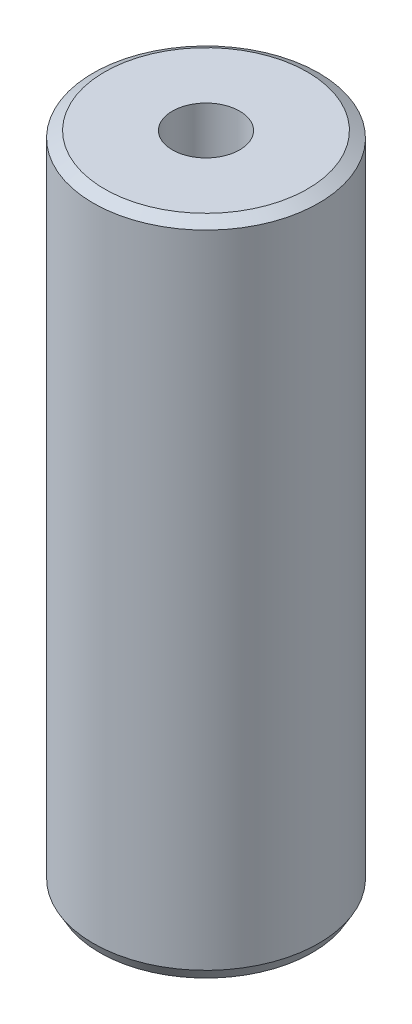
ISO-10303-21;
HEADER;
FILE_DESCRIPTION(('STEP AP214'),'2;1');
FILE_NAME('part.step','',(''),(''),'','','');
FILE_SCHEMA(('AUTOMOTIVE_DESIGN { 1 0 10303 214 1 1 1 1 }'));
ENDSEC;
DATA;
#1=APPLICATION_CONTEXT('core data for automotive mechanical design processes');
#2=APPLICATION_PROTOCOL_DEFINITION('international standard','automotive_design',2000,#1);
#3=PRODUCT_CONTEXT('',#1,'mechanical');
#4=PRODUCT('Part','Part','',(#3));
#5=PRODUCT_RELATED_PRODUCT_CATEGORY('part','',(#4));
#6=PRODUCT_DEFINITION_FORMATION('','',#4);
#7=PRODUCT_DEFINITION_CONTEXT('part definition',#1,'design');
#8=PRODUCT_DEFINITION('design','',#6,#7);
#9=PRODUCT_DEFINITION_SHAPE('','',#8);
#10=(LENGTH_UNIT() NAMED_UNIT(*) SI_UNIT(.MILLI.,.METRE.));
#11=(NAMED_UNIT(*) PLANE_ANGLE_UNIT() SI_UNIT($,.RADIAN.));
#12=(NAMED_UNIT(*) SI_UNIT($,.STERADIAN.) SOLID_ANGLE_UNIT());
#13=UNCERTAINTY_MEASURE_WITH_UNIT(LENGTH_MEASURE(1.E-05),#10,'distance_accuracy_value','');
#14=(GEOMETRIC_REPRESENTATION_CONTEXT(3) GLOBAL_UNCERTAINTY_ASSIGNED_CONTEXT((#13)) GLOBAL_UNIT_ASSIGNED_CONTEXT((#10,
#11,#12)) REPRESENTATION_CONTEXT('',''));
#15=CARTESIAN_POINT('',(0.,0.,0.));
#16=DIRECTION('',(0.,0.,1.));
#17=DIRECTION('',(1.,0.,0.));
#18=AXIS2_PLACEMENT_3D('',#15,#16,#17);
#19=CARTESIAN_POINT('',(0.,189.898432150848,0.));
#20=DIRECTION('',(0.,-1.,0.));
#21=DIRECTION('',(0.,0.,-1.));
#22=AXIS2_PLACEMENT_3D('',#19,#20,#21);
#23=CYLINDRICAL_SURFACE('',#22,32.5);
#24=CARTESIAN_POINT('',(0.,188.01309010159,0.));
#25=DIRECTION('',(0.,1.,0.));
#26=DIRECTION('',(0.,0.,1.));
#27=AXIS2_PLACEMENT_3D('',#24,#25,#26);
#28=CIRCLE('',#27,32.5);
#29=CARTESIAN_POINT('',(0.,188.01309010159,-32.5));
#30=VERTEX_POINT('',#29);
#31=EDGE_CURVE('E50',#30,#30,#28,.F.);
#32=ORIENTED_EDGE('',*,*,#31,.T.);
#33=EDGE_LOOP('',(#32));
#34=FACE_BOUND('',#33,.T.);
#35=CARTESIAN_POINT('',(0.,3.26550821896204,0.));
#36=DIRECTION('',(0.,1.,0.));
#37=DIRECTION('',(0.,0.,1.));
#38=AXIS2_PLACEMENT_3D('',#35,#36,#37);
#39=CIRCLE('',#38,32.5);
#40=CARTESIAN_POINT('',(0.,3.26550821896204,32.5));
#41=VERTEX_POINT('',#40);
#42=EDGE_CURVE('E51',#41,#41,#39,.T.);
#43=ORIENTED_EDGE('',*,*,#42,.T.);
#44=EDGE_LOOP('',(#43));
#45=FACE_BOUND('',#44,.T.);
#46=ADVANCED_FACE('F39',(#34,#45),#23,.T.);
#47=CARTESIAN_POINT('',(0.,189.898432150848,0.));
#48=DIRECTION('',(0.,1.,0.));
#49=DIRECTION('',(0.,0.,1.));
#50=AXIS2_PLACEMENT_3D('',#47,#48,#49);
#51=PLANE('',#50);
#52=CARTESIAN_POINT('',(0.,189.898432150848,0.));
#53=DIRECTION('',(0.,1.,0.));
#54=DIRECTION('',(0.,0.,1.));
#55=AXIS2_PLACEMENT_3D('',#52,#53,#54);
#56=CIRCLE('',#55,29.234491781038);
#57=CARTESIAN_POINT('',(0.,189.898432150848,-29.234491781038));
#58=VERTEX_POINT('',#57);
#59=EDGE_CURVE('E54',#58,#58,#56,.T.);
#60=ORIENTED_EDGE('',*,*,#59,.T.);
#61=EDGE_LOOP('',(#60));
#62=FACE_BOUND('',#61,.T.);
#63=CARTESIAN_POINT('',(0.,189.898432150848,0.));
#64=DIRECTION('',(0.,1.,0.));
#65=DIRECTION('',(0.,0.,1.));
#66=AXIS2_PLACEMENT_3D('',#63,#64,#65);
#67=CIRCLE('',#66,9.69932187311989);
#68=CARTESIAN_POINT('',(0.,189.898432150848,9.69932187311989));
#69=VERTEX_POINT('',#68);
#70=EDGE_CURVE('E58',#69,#69,#67,.T.);
#71=ORIENTED_EDGE('',*,*,#70,.F.);
#72=EDGE_LOOP('',(#71));
#73=FACE_BOUND('',#72,.T.);
#74=ADVANCED_FACE('F69',(#62,#73),#51,.T.);
#75=CARTESIAN_POINT('',(0.,0.,0.));
#76=DIRECTION('',(0.,1.,0.));
#77=DIRECTION('',(0.,0.,1.));
#78=AXIS2_PLACEMENT_3D('',#75,#76,#77);
#79=PLANE('',#78);
#80=CARTESIAN_POINT('',(0.,0.,0.));
#81=DIRECTION('',(0.,1.,0.));
#82=DIRECTION('',(0.,0.,1.));
#83=AXIS2_PLACEMENT_3D('',#80,#81,#82);
#84=CIRCLE('',#83,30.6146579507413);
#85=CARTESIAN_POINT('',(0.,0.,30.6146579507413));
#86=VERTEX_POINT('',#85);
#87=EDGE_CURVE('E10',#86,#86,#84,.F.);
#88=ORIENTED_EDGE('',*,*,#87,.T.);
#89=EDGE_LOOP('',(#88));
#90=FACE_BOUND('',#89,.T.);
#91=CARTESIAN_POINT('',(0.,0.,0.));
#92=DIRECTION('',(0.,1.,0.));
#93=DIRECTION('',(0.,0.,1.));
#94=AXIS2_PLACEMENT_3D('',#91,#92,#93);
#95=CIRCLE('',#94,9.69932187311989);
#96=CARTESIAN_POINT('',(0.,0.,9.69932187311989));
#97=VERTEX_POINT('',#96);
#98=EDGE_CURVE('E63',#97,#97,#95,.T.);
#99=ORIENTED_EDGE('',*,*,#98,.T.);
#100=EDGE_LOOP('',(#99));
#101=FACE_BOUND('',#100,.T.);
#102=ADVANCED_FACE('F75',(#90,#101),#79,.F.);
#103=CARTESIAN_POINT('',(0.,189.898432150848,0.));
#104=DIRECTION('',(0.,-1.,0.));
#105=DIRECTION('',(0.,0.,-1.));
#106=AXIS2_PLACEMENT_3D('',#103,#104,#105);
#107=CYLINDRICAL_SURFACE('',#106,9.69932187311989);
#108=ORIENTED_EDGE('',*,*,#70,.T.);
#109=EDGE_LOOP('',(#108));
#110=FACE_BOUND('',#109,.T.);
#111=ORIENTED_EDGE('',*,*,#98,.F.);
#112=EDGE_LOOP('',(#111));
#113=FACE_BOUND('',#112,.T.);
#114=ADVANCED_FACE('F70',(#110,#113),#107,.F.);
#115=CARTESIAN_POINT('',(0.,189.898432150848,0.));
#116=DIRECTION('',(0.,-1.,0.));
#117=DIRECTION('',(0.,0.,-1.));
#118=AXIS2_PLACEMENT_3D('',#115,#116,#117);
#119=CONICAL_SURFACE('',#118,29.234491781038,1.04719755119659);
#120=CARTESIAN_POINT('',(0.,188.01309010159,-32.5));
#121=CARTESIAN_POINT('',(0.,188.032729081269,-32.4659842893858));
#122=CARTESIAN_POINT('',(0.,188.052368060949,-32.4319685787716));
#123=CARTESIAN_POINT('',(0.,188.091646020309,-32.3639371575433));
#124=CARTESIAN_POINT('',(0.,188.111284999989,-32.3299214469291));
#125=CARTESIAN_POINT('',(0.,188.150562959348,-32.2618900257007));
#126=CARTESIAN_POINT('',(0.,188.170201939028,-32.2278743150865));
#127=CARTESIAN_POINT('',(0.,188.209479898387,-32.1598428938581));
#128=CARTESIAN_POINT('',(0.,188.229118878067,-32.125827183244));
#129=CARTESIAN_POINT('',(0.,188.268396837427,-32.0577957620156));
#130=CARTESIAN_POINT('',(0.,188.288035817107,-32.0237800514014));
#131=CARTESIAN_POINT('',(0.,188.327313776466,-31.955748630173));
#132=CARTESIAN_POINT('',(0.,188.346952756146,-31.9217329195588));
#133=CARTESIAN_POINT('',(0.,188.386230715505,-31.8537014983305));
#134=CARTESIAN_POINT('',(0.,188.405869695185,-31.8196857877163));
#135=CARTESIAN_POINT('',(0.,188.445147654545,-31.7516543664879));
#136=CARTESIAN_POINT('',(0.,188.464786634225,-31.7176386558737));
#137=CARTESIAN_POINT('',(0.,188.504064593584,-31.6496072346453));
#138=CARTESIAN_POINT('',(0.,188.523703573264,-31.6155915240311));
#139=CARTESIAN_POINT('',(0.,188.562981532623,-31.5475601028028));
#140=CARTESIAN_POINT('',(0.,188.582620512303,-31.5135443921886));
#141=CARTESIAN_POINT('',(0.,188.621898471663,-31.4455129709602));
#142=CARTESIAN_POINT('',(0.,188.641537451343,-31.411497260346));
#143=CARTESIAN_POINT('',(0.,188.680815410702,-31.3434658391176));
#144=CARTESIAN_POINT('',(0.,188.700454390382,-31.3094501285034));
#145=CARTESIAN_POINT('',(0.,188.739732349741,-31.2414187072751));
#146=CARTESIAN_POINT('',(0.,188.759371329421,-31.2074029966609));
#147=CARTESIAN_POINT('',(0.,188.798649288781,-31.1393715754325));
#148=CARTESIAN_POINT('',(0.,188.818288268461,-31.1053558648183));
#149=CARTESIAN_POINT('',(0.,188.85756622782,-31.0373244435899));
#150=CARTESIAN_POINT('',(0.,188.8772052075,-31.0033087329758));
#151=CARTESIAN_POINT('',(0.,188.916483166859,-30.9352773117474));
#152=CARTESIAN_POINT('',(0.,188.936122146539,-30.9012616011332));
#153=CARTESIAN_POINT('',(0.,188.975400105899,-30.8332301799048));
#154=CARTESIAN_POINT('',(0.,188.995039085579,-30.7992144692906));
#155=CARTESIAN_POINT('',(0.,189.034317044938,-30.7311830480623));
#156=CARTESIAN_POINT('',(0.,189.053956024618,-30.6971673374481));
#157=CARTESIAN_POINT('',(0.,189.093233983977,-30.6291359162197));
#158=CARTESIAN_POINT('',(0.,189.112872963657,-30.5951202056055));
#159=CARTESIAN_POINT('',(0.,189.152150923017,-30.5270887843771));
#160=CARTESIAN_POINT('',(0.,189.171789902697,-30.4930730737629));
#161=CARTESIAN_POINT('',(0.,189.211067862056,-30.4250416525346));
#162=CARTESIAN_POINT('',(0.,189.230706841736,-30.3910259419204));
#163=CARTESIAN_POINT('',(0.,189.269984801095,-30.322994520692));
#164=CARTESIAN_POINT('',(0.,189.289623780775,-30.2889788100778));
#165=CARTESIAN_POINT('',(0.,189.328901740135,-30.2209473888494));
#166=CARTESIAN_POINT('',(0.,189.348540719815,-30.1869316782352));
#167=CARTESIAN_POINT('',(0.,189.387818679174,-30.1189002570069));
#168=CARTESIAN_POINT('',(0.,189.407457658854,-30.0848845463927));
#169=CARTESIAN_POINT('',(0.,189.446735618213,-30.0168531251643));
#170=CARTESIAN_POINT('',(0.,189.466374597893,-29.9828374145501));
#171=CARTESIAN_POINT('',(0.,189.505652557253,-29.9148059933217));
#172=CARTESIAN_POINT('',(0.,189.525291536933,-29.8807902827076));
#173=CARTESIAN_POINT('',(0.,189.564569496292,-29.8127588614792));
#174=CARTESIAN_POINT('',(0.,189.584208475972,-29.778743150865));
#175=CARTESIAN_POINT('',(0.,189.623486435331,-29.7107117296366));
#176=CARTESIAN_POINT('',(0.,189.643125415011,-29.6766960190224));
#177=CARTESIAN_POINT('',(0.,189.682403374371,-29.608664597794));
#178=CARTESIAN_POINT('',(0.,189.702042354051,-29.5746488871799));
#179=CARTESIAN_POINT('',(0.,189.74132031341,-29.5066174659515));
#180=CARTESIAN_POINT('',(0.,189.76095929309,-29.4726017553373));
#181=CARTESIAN_POINT('',(0.,189.800237252449,-29.4045703341089));
#182=CARTESIAN_POINT('',(0.,189.819876232129,-29.3705546234947));
#183=CARTESIAN_POINT('',(0.,189.859154191489,-29.3025232022664));
#184=CARTESIAN_POINT('',(0.,189.878793171169,-29.2685074916522));
#185=CARTESIAN_POINT('',(0.,189.898432150848,-29.234491781038));
#186=B_SPLINE_CURVE_WITH_KNOTS('',3,(#120,#121,#122,#123,#124,#125,#126,#127,#128,#129,#130,
#131,#132,#133,#134,#135,#136,#137,#138,#139,#140,#141,#142,#143,#144,#145,#146,#147,#148,#149,
#150,#151,#152,#153,#154,#155,#156,#157,#158,#159,#160,#161,#162,#163,#164,#165,#166,#167,#168,
#169,#170,#171,#172,#173,#174,#175,#176,#177,#178,#179,#180,#181,#182,#183,#184,#185),
.UNSPECIFIED.,.F.,.F.,(4,2,2,2,2,2,2,2,2,2,2,2,2,2,2,2,2,2,2,2,2,2,2,2,2,2,2,2,2,2,2,2,4),(0.,
0.117833878078651,0.235667756157322,0.353501634235993,0.471335512314664,0.589169390393329,
0.707003268472,0.824837146550657,0.942671024629328,1.06050490270799,1.17833878078666,
1.29617265886533,1.41400653694401,1.53184041502266,1.64967429310133,1.76750817118,
1.88534204925867,2.00317592733734,2.121009805416,2.23884368349468,2.35667756157333,
2.474511439652,2.59234531773067,2.71017919580934,2.82801307388801,2.94584695196668,
3.06368083004533,3.181514708124,3.29934858620267,3.41718246428134,3.53501634236001,
3.65285022043868,3.77068409851735),.UNSPECIFIED.);
#187=EDGE_CURVE('BSEAM81',#30,#58,#186,.T.);
#188=ORIENTED_EDGE('',*,*,#31,.F.);
#189=ORIENTED_EDGE('',*,*,#59,.F.);
#190=ORIENTED_EDGE('',*,*,#187,.T.);
#191=ORIENTED_EDGE('',*,*,#187,.F.);
#192=EDGE_LOOP('',(#188,#190,#189,#191));
#193=FACE_BOUND('',#192,.T.);
#194=ADVANCED_FACE('F81',(#193),#119,.T.);
#195=CARTESIAN_POINT('',(0.,3.26550821896204,0.));
#196=DIRECTION('',(0.,1.,0.));
#197=DIRECTION('',(0.,0.,1.));
#198=AXIS2_PLACEMENT_3D('',#195,#196,#197);
#199=CONICAL_SURFACE('',#198,32.5,0.523598775598304);
#200=ORIENTED_EDGE('',*,*,#87,.F.);
#201=EDGE_LOOP('',(#200));
#202=FACE_BOUND('',#201,.T.);
#203=ORIENTED_EDGE('',*,*,#42,.F.);
#204=EDGE_LOOP('',(#203));
#205=FACE_BOUND('',#204,.T.);
#206=ADVANCED_FACE('F45',(#202,#205),#199,.T.);
#207=CLOSED_SHELL('',(#46,#74,#102,#114,#194,#206));
#208=MANIFOLD_SOLID_BREP('B2',#207);
#209=ADVANCED_BREP_SHAPE_REPRESENTATION('',(#18,#208),#14);
#210=SHAPE_DEFINITION_REPRESENTATION(#9,#209);
ENDSEC;
END-ISO-10303-21;
